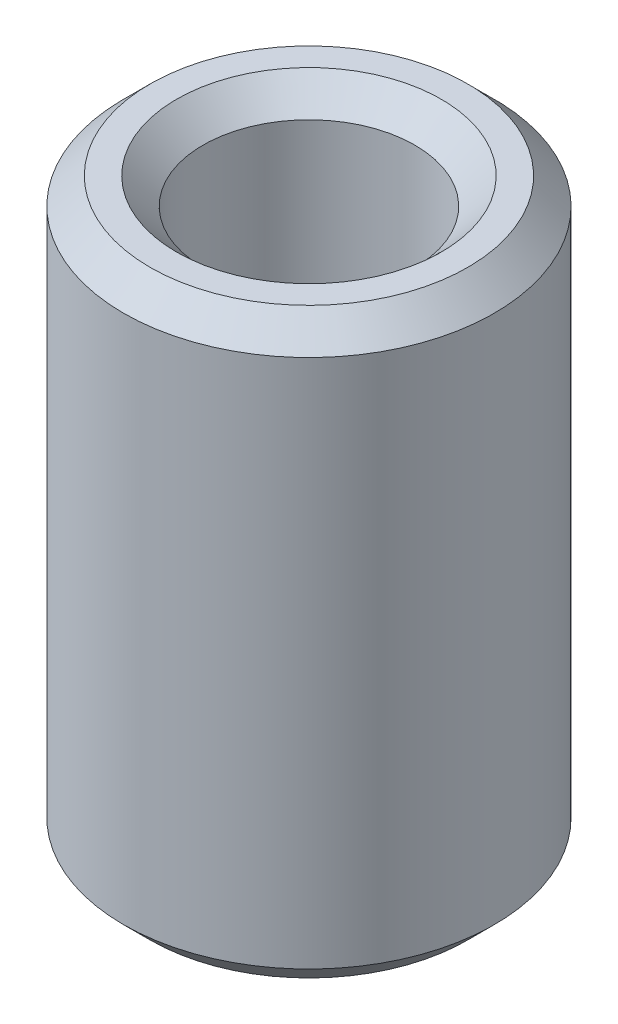
ISO-10303-21;
HEADER;
FILE_DESCRIPTION(('STEP AP214'),'2;1');
FILE_NAME('part.step','',(''),(''),'','','');
FILE_SCHEMA(('AUTOMOTIVE_DESIGN { 1 0 10303 214 1 1 1 1 }'));
ENDSEC;
DATA;
#1=APPLICATION_CONTEXT('core data for automotive mechanical design processes');
#2=APPLICATION_PROTOCOL_DEFINITION('international standard','automotive_design',2000,#1);
#3=PRODUCT_CONTEXT('',#1,'mechanical');
#4=PRODUCT('Part','Part','',(#3));
#5=PRODUCT_RELATED_PRODUCT_CATEGORY('part','',(#4));
#6=PRODUCT_DEFINITION_FORMATION('','',#4);
#7=PRODUCT_DEFINITION_CONTEXT('part definition',#1,'design');
#8=PRODUCT_DEFINITION('design','',#6,#7);
#9=PRODUCT_DEFINITION_SHAPE('','',#8);
#10=(LENGTH_UNIT() NAMED_UNIT(*) SI_UNIT(.MILLI.,.METRE.));
#11=(NAMED_UNIT(*) PLANE_ANGLE_UNIT() SI_UNIT($,.RADIAN.));
#12=(NAMED_UNIT(*) SI_UNIT($,.STERADIAN.) SOLID_ANGLE_UNIT());
#13=UNCERTAINTY_MEASURE_WITH_UNIT(LENGTH_MEASURE(1.E-05),#10,'distance_accuracy_value','');
#14=(GEOMETRIC_REPRESENTATION_CONTEXT(3) GLOBAL_UNCERTAINTY_ASSIGNED_CONTEXT((#13)) GLOBAL_UNIT_ASSIGNED_CONTEXT((#10,
#11,#12)) REPRESENTATION_CONTEXT('',''));
#15=CARTESIAN_POINT('',(0.,0.,0.));
#16=DIRECTION('',(0.,0.,1.));
#17=DIRECTION('',(1.,0.,0.));
#18=AXIS2_PLACEMENT_3D('',#15,#16,#17);
#19=CARTESIAN_POINT('',(0.,22.,0.));
#20=DIRECTION('',(0.,1.,0.));
#21=DIRECTION('',(0.,0.,1.));
#22=AXIS2_PLACEMENT_3D('',#19,#20,#21);
#23=PLANE('',#22);
#24=CARTESIAN_POINT('',(0.,22.,0.));
#25=DIRECTION('',(0.,1.,0.));
#26=DIRECTION('',(0.,0.,1.));
#27=AXIS2_PLACEMENT_3D('',#24,#25,#26);
#28=CIRCLE('',#27,6.);
#29=CARTESIAN_POINT('',(0.,22.,6.));
#30=VERTEX_POINT('',#29);
#31=EDGE_CURVE('E10',#30,#30,#28,.T.);
#32=ORIENTED_EDGE('',*,*,#31,.T.);
#33=EDGE_LOOP('',(#32));
#34=FACE_BOUND('',#33,.T.);
#35=CARTESIAN_POINT('',(0.,22.,0.));
#36=DIRECTION('',(0.,1.,0.));
#37=DIRECTION('',(0.,0.,1.));
#38=AXIS2_PLACEMENT_3D('',#35,#36,#37);
#39=CIRCLE('',#38,5.00000000000002);
#40=CARTESIAN_POINT('',(0.,22.,5.00000000000002));
#41=VERTEX_POINT('',#40);
#42=EDGE_CURVE('E56',#41,#41,#39,.F.);
#43=ORIENTED_EDGE('',*,*,#42,.T.);
#44=EDGE_LOOP('',(#43));
#45=FACE_BOUND('',#44,.T.);
#46=ADVANCED_FACE('F47',(#34,#45),#23,.T.);
#47=CARTESIAN_POINT('',(0.,0.,0.));
#48=DIRECTION('',(0.,1.,0.));
#49=DIRECTION('',(0.,0.,1.));
#50=AXIS2_PLACEMENT_3D('',#47,#48,#49);
#51=PLANE('',#50);
#52=CARTESIAN_POINT('',(0.,0.,0.));
#53=DIRECTION('',(0.,1.,0.));
#54=DIRECTION('',(0.,0.,1.));
#55=AXIS2_PLACEMENT_3D('',#52,#53,#54);
#56=CIRCLE('',#55,5.);
#57=CARTESIAN_POINT('',(0.,0.,5.));
#58=VERTEX_POINT('',#57);
#59=EDGE_CURVE('E80',#58,#58,#56,.T.);
#60=ORIENTED_EDGE('',*,*,#59,.T.);
#61=EDGE_LOOP('',(#60));
#62=FACE_BOUND('',#61,.T.);
#63=CARTESIAN_POINT('',(0.,0.,0.));
#64=DIRECTION('',(0.,1.,0.));
#65=DIRECTION('',(0.,0.,1.));
#66=AXIS2_PLACEMENT_3D('',#63,#64,#65);
#67=CIRCLE('',#66,6.);
#68=CARTESIAN_POINT('',(0.,0.,6.));
#69=VERTEX_POINT('',#68);
#70=EDGE_CURVE('E84',#69,#69,#67,.F.);
#71=ORIENTED_EDGE('',*,*,#70,.T.);
#72=EDGE_LOOP('',(#71));
#73=FACE_BOUND('',#72,.T.);
#74=ADVANCED_FACE('F89',(#62,#73),#51,.F.);
#75=CARTESIAN_POINT('',(0.,22.,0.));
#76=DIRECTION('',(0.,-1.,0.));
#77=DIRECTION('',(0.,0.,-1.));
#78=AXIS2_PLACEMENT_3D('',#75,#76,#77);
#79=CYLINDRICAL_SURFACE('',#78,7.);
#80=CARTESIAN_POINT('',(0.,0.999999999999997,0.));
#81=DIRECTION('',(0.,1.,0.));
#82=DIRECTION('',(0.,0.,1.));
#83=AXIS2_PLACEMENT_3D('',#80,#81,#82);
#84=CIRCLE('',#83,7.);
#85=CARTESIAN_POINT('',(0.,0.999999999999997,7.));
#86=VERTEX_POINT('',#85);
#87=EDGE_CURVE('E61',#86,#86,#84,.T.);
#88=ORIENTED_EDGE('',*,*,#87,.T.);
#89=EDGE_LOOP('',(#88));
#90=FACE_BOUND('',#89,.T.);
#91=CARTESIAN_POINT('',(0.,21.,0.));
#92=DIRECTION('',(0.,1.,0.));
#93=DIRECTION('',(0.,0.,1.));
#94=AXIS2_PLACEMENT_3D('',#91,#92,#93);
#95=CIRCLE('',#94,7.);
#96=CARTESIAN_POINT('',(0.,21.,7.));
#97=VERTEX_POINT('',#96);
#98=EDGE_CURVE('E66',#97,#97,#95,.F.);
#99=ORIENTED_EDGE('',*,*,#98,.T.);
#100=EDGE_LOOP('',(#99));
#101=FACE_BOUND('',#100,.T.);
#102=ADVANCED_FACE('F99',(#90,#101),#79,.T.);
#103=CARTESIAN_POINT('',(0.,22.,0.));
#104=DIRECTION('',(0.,-1.,0.));
#105=DIRECTION('',(0.,0.,-1.));
#106=AXIS2_PLACEMENT_3D('',#103,#104,#105);
#107=CYLINDRICAL_SURFACE('',#106,4.);
#108=CARTESIAN_POINT('',(0.,1.,0.));
#109=DIRECTION('',(0.,1.,0.));
#110=DIRECTION('',(0.,0.,1.));
#111=AXIS2_PLACEMENT_3D('',#108,#109,#110);
#112=CIRCLE('',#111,4.);
#113=CARTESIAN_POINT('',(0.,1.,4.));
#114=VERTEX_POINT('',#113);
#115=EDGE_CURVE('E72',#114,#114,#112,.F.);
#116=ORIENTED_EDGE('',*,*,#115,.T.);
#117=EDGE_LOOP('',(#116));
#118=FACE_BOUND('',#117,.T.);
#119=CARTESIAN_POINT('',(0.,21.,0.));
#120=DIRECTION('',(0.,1.,0.));
#121=DIRECTION('',(0.,0.,1.));
#122=AXIS2_PLACEMENT_3D('',#119,#120,#121);
#123=CIRCLE('',#122,4.);
#124=CARTESIAN_POINT('',(0.,21.,4.));
#125=VERTEX_POINT('',#124);
#126=EDGE_CURVE('E76',#125,#125,#123,.T.);
#127=ORIENTED_EDGE('',*,*,#126,.T.);
#128=EDGE_LOOP('',(#127));
#129=FACE_BOUND('',#128,.T.);
#130=ADVANCED_FACE('F102',(#118,#129),#107,.F.);
#131=CARTESIAN_POINT('',(0.,0.,0.));
#132=DIRECTION('',(0.,-1.,0.));
#133=DIRECTION('',(0.,0.,-1.));
#134=AXIS2_PLACEMENT_3D('',#131,#132,#133);
#135=CONICAL_SURFACE('',#134,5.,0.785398163397447);
#136=ORIENTED_EDGE('',*,*,#115,.F.);
#137=EDGE_LOOP('',(#136));
#138=FACE_BOUND('',#137,.T.);
#139=ORIENTED_EDGE('',*,*,#59,.F.);
#140=EDGE_LOOP('',(#139));
#141=FACE_BOUND('',#140,.T.);
#142=ADVANCED_FACE('F95',(#138,#141),#135,.F.);
#143=CARTESIAN_POINT('',(0.,0.999999999999997,0.));
#144=DIRECTION('',(0.,1.,0.));
#145=DIRECTION('',(0.,0.,1.));
#146=AXIS2_PLACEMENT_3D('',#143,#144,#145);
#147=CONICAL_SURFACE('',#146,7.,0.78539816339745);
#148=ORIENTED_EDGE('',*,*,#70,.F.);
#149=EDGE_LOOP('',(#148));
#150=FACE_BOUND('',#149,.T.);
#151=ORIENTED_EDGE('',*,*,#87,.F.);
#152=EDGE_LOOP('',(#151));
#153=FACE_BOUND('',#152,.T.);
#154=ADVANCED_FACE('F91',(#150,#153),#147,.T.);
#155=CARTESIAN_POINT('',(0.,22.,0.));
#156=DIRECTION('',(0.,-1.,0.));
#157=DIRECTION('',(0.,0.,-1.));
#158=AXIS2_PLACEMENT_3D('',#155,#156,#157);
#159=CONICAL_SURFACE('',#158,6.,0.785398163397445);
#160=ORIENTED_EDGE('',*,*,#98,.F.);
#161=EDGE_LOOP('',(#160));
#162=FACE_BOUND('',#161,.T.);
#163=ORIENTED_EDGE('',*,*,#31,.F.);
#164=EDGE_LOOP('',(#163));
#165=FACE_BOUND('',#164,.T.);
#166=ADVANCED_FACE('F94',(#162,#165),#159,.T.);
#167=CARTESIAN_POINT('',(0.,21.,0.));
#168=DIRECTION('',(0.,1.,0.));
#169=DIRECTION('',(0.,0.,1.));
#170=AXIS2_PLACEMENT_3D('',#167,#168,#169);
#171=CONICAL_SURFACE('',#170,4.,0.78539816339745);
#172=ORIENTED_EDGE('',*,*,#42,.F.);
#173=EDGE_LOOP('',(#172));
#174=FACE_BOUND('',#173,.T.);
#175=ORIENTED_EDGE('',*,*,#126,.F.);
#176=EDGE_LOOP('',(#175));
#177=FACE_BOUND('',#176,.T.);
#178=ADVANCED_FACE('F50',(#174,#177),#171,.F.);
#179=CLOSED_SHELL('',(#46,#74,#102,#130,#142,#154,#166,#178));
#180=MANIFOLD_SOLID_BREP('B2',#179);
#181=ADVANCED_BREP_SHAPE_REPRESENTATION('',(#18,#180),#14);
#182=SHAPE_DEFINITION_REPRESENTATION(#9,#181);
ENDSEC;
END-ISO-10303-21;
